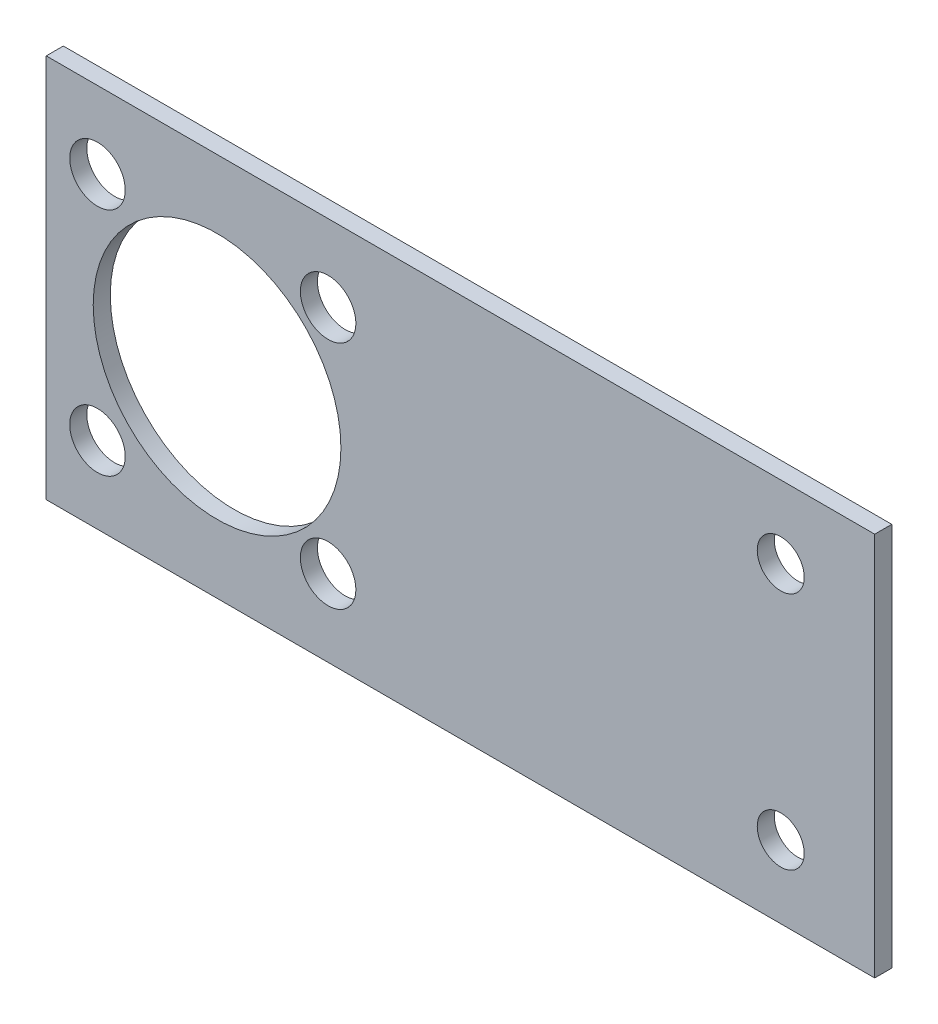
ISO-10303-21;
HEADER;
FILE_DESCRIPTION(('STEP AP214'),'2;1');
FILE_NAME('part.step','',(''),(''),'','','');
FILE_SCHEMA(('AUTOMOTIVE_DESIGN { 1 0 10303 214 1 1 1 1 }'));
ENDSEC;
DATA;
#1=APPLICATION_CONTEXT('core data for automotive mechanical design processes');
#2=APPLICATION_PROTOCOL_DEFINITION('international standard','automotive_design',2000,#1);
#3=PRODUCT_CONTEXT('',#1,'mechanical');
#4=PRODUCT('Part','Part','',(#3));
#5=PRODUCT_RELATED_PRODUCT_CATEGORY('part','',(#4));
#6=PRODUCT_DEFINITION_FORMATION('','',#4);
#7=PRODUCT_DEFINITION_CONTEXT('part definition',#1,'design');
#8=PRODUCT_DEFINITION('design','',#6,#7);
#9=PRODUCT_DEFINITION_SHAPE('','',#8);
#10=(LENGTH_UNIT() NAMED_UNIT(*) SI_UNIT(.MILLI.,.METRE.));
#11=(NAMED_UNIT(*) PLANE_ANGLE_UNIT() SI_UNIT($,.RADIAN.));
#12=(NAMED_UNIT(*) SI_UNIT($,.STERADIAN.) SOLID_ANGLE_UNIT());
#13=UNCERTAINTY_MEASURE_WITH_UNIT(LENGTH_MEASURE(1.E-05),#10,'distance_accuracy_value','');
#14=(GEOMETRIC_REPRESENTATION_CONTEXT(3) GLOBAL_UNCERTAINTY_ASSIGNED_CONTEXT((#13)) GLOBAL_UNIT_ASSIGNED_CONTEXT((#10,
#11,#12)) REPRESENTATION_CONTEXT('',''));
#15=CARTESIAN_POINT('',(0.,0.,0.));
#16=DIRECTION('',(0.,0.,1.));
#17=DIRECTION('',(1.,0.,0.));
#18=AXIS2_PLACEMENT_3D('',#15,#16,#17);
#19=CARTESIAN_POINT('',(37.991244901112,22.5,-1.99999999999999));
#20=DIRECTION('',(0.,1.,0.));
#21=DIRECTION('',(1.,0.,0.));
#22=AXIS2_PLACEMENT_3D('',#19,#20,#21);
#23=PLANE('',#22);
#24=DIRECTION('',(-1.,0.,0.));
#25=VECTOR('',#24,1.);
#26=CARTESIAN_POINT('',(37.991244901112,22.5,-1.99999999999999));
#27=LINE('',#26,#25);
#28=CARTESIAN_POINT('',(60.991244901112,22.5,-2.00000000000016));
#29=VERTEX_POINT('',#28);
#30=CARTESIAN_POINT('',(-36.,22.5,-2.));
#31=VERTEX_POINT('',#30);
#32=EDGE_CURVE('E117',#29,#31,#27,.T.);
#33=ORIENTED_EDGE('',*,*,#32,.T.);
#34=DIRECTION('',(0.,0.,1.));
#35=VECTOR('',#34,1.);
#36=CARTESIAN_POINT('',(-36.,22.5,-2.));
#37=LINE('',#36,#35);
#38=CARTESIAN_POINT('',(-36.,22.5,0.));
#39=VERTEX_POINT('',#38);
#40=EDGE_CURVE('E119',#31,#39,#37,.T.);
#41=ORIENTED_EDGE('',*,*,#40,.T.);
#42=DIRECTION('',(1.,0.,0.));
#43=VECTOR('',#42,1.);
#44=CARTESIAN_POINT('',(37.9912449011119,22.5,0.));
#45=LINE('',#44,#43);
#46=CARTESIAN_POINT('',(60.991244901112,22.5,-1.59594559789866E-13));
#47=VERTEX_POINT('',#46);
#48=EDGE_CURVE('E108',#47,#39,#45,.F.);
#49=ORIENTED_EDGE('',*,*,#48,.F.);
#50=DIRECTION('',(0.,0.,1.));
#51=VECTOR('',#50,1.);
#52=CARTESIAN_POINT('',(60.991244901112,22.5,-2.00000000000016));
#53=LINE('',#52,#51);
#54=EDGE_CURVE('E13',#29,#47,#53,.T.);
#55=ORIENTED_EDGE('',*,*,#54,.F.);
#56=EDGE_LOOP('',(#33,#41,#49,#55));
#57=FACE_BOUND('',#56,.T.);
#58=ADVANCED_FACE('F69',(#57),#23,.T.);
#59=CARTESIAN_POINT('',(60.991244901112,-22.5,-2.00000000000016));
#60=DIRECTION('',(0.,-1.,0.));
#61=DIRECTION('',(-1.,0.,0.));
#62=AXIS2_PLACEMENT_3D('',#59,#60,#61);
#63=PLANE('',#62);
#64=DIRECTION('',(-1.,0.,0.));
#65=VECTOR('',#64,1.);
#66=CARTESIAN_POINT('',(37.9912449011119,-22.5,0.));
#67=LINE('',#66,#65);
#68=CARTESIAN_POINT('',(-36.,-22.5,0.));
#69=VERTEX_POINT('',#68);
#70=CARTESIAN_POINT('',(60.991244901112,-22.5,-1.59594559789866E-13));
#71=VERTEX_POINT('',#70);
#72=EDGE_CURVE('E103',#69,#71,#67,.F.);
#73=ORIENTED_EDGE('',*,*,#72,.F.);
#74=DIRECTION('',(0.,0.,1.));
#75=VECTOR('',#74,1.);
#76=CARTESIAN_POINT('',(-36.,-22.5,-2.));
#77=LINE('',#76,#75);
#78=CARTESIAN_POINT('',(-36.,-22.5,-2.));
#79=VERTEX_POINT('',#78);
#80=EDGE_CURVE('E139',#79,#69,#77,.T.);
#81=ORIENTED_EDGE('',*,*,#80,.F.);
#82=DIRECTION('',(1.,0.,0.));
#83=VECTOR('',#82,1.);
#84=CARTESIAN_POINT('',(60.991244901112,-22.5,-2.00000000000016));
#85=LINE('',#84,#83);
#86=CARTESIAN_POINT('',(60.991244901112,-22.5,-2.00000000000016));
#87=VERTEX_POINT('',#86);
#88=EDGE_CURVE('E137',#79,#87,#85,.T.);
#89=ORIENTED_EDGE('',*,*,#88,.T.);
#90=DIRECTION('',(0.,0.,1.));
#91=VECTOR('',#90,1.);
#92=CARTESIAN_POINT('',(60.991244901112,-22.5,-2.00000000000016));
#93=LINE('',#92,#91);
#94=EDGE_CURVE('E80',#87,#71,#93,.T.);
#95=ORIENTED_EDGE('',*,*,#94,.T.);
#96=EDGE_LOOP('',(#73,#81,#89,#95));
#97=FACE_BOUND('',#96,.T.);
#98=ADVANCED_FACE('F191',(#97),#63,.T.);
#99=CARTESIAN_POINT('',(37.9912449011119,0.,-1.99999999999999));
#100=DIRECTION('',(0.,0.,-1.));
#101=DIRECTION('',(-1.,0.,0.));
#102=AXIS2_PLACEMENT_3D('',#99,#100,#101);
#103=PLANE('',#102);
#104=CARTESIAN_POINT('',(49.991244901112,14.,-2.00000000000008));
#105=DIRECTION('',(0.,0.,-1.));
#106=DIRECTION('',(-1.,0.,0.));
#107=AXIS2_PLACEMENT_3D('',#104,#105,#106);
#108=CIRCLE('',#107,2.75);
#109=CARTESIAN_POINT('',(47.241244901112,14.,-2.00000000000006));
#110=VERTEX_POINT('',#109);
#111=EDGE_CURVE('E146',#110,#110,#108,.T.);
#112=ORIENTED_EDGE('',*,*,#111,.F.);
#113=EDGE_LOOP('',(#112));
#114=FACE_BOUND('',#113,.T.);
#115=CARTESIAN_POINT('',(49.991244901112,-14.,-2.00000000000008));
#116=DIRECTION('',(0.,0.,-1.));
#117=DIRECTION('',(-1.,0.,0.));
#118=AXIS2_PLACEMENT_3D('',#115,#116,#117);
#119=CIRCLE('',#118,2.75);
#120=CARTESIAN_POINT('',(47.241244901112,-14.,-2.00000000000006));
#121=VERTEX_POINT('',#120);
#122=EDGE_CURVE('E133',#121,#121,#119,.T.);
#123=ORIENTED_EDGE('',*,*,#122,.F.);
#124=EDGE_LOOP('',(#123));
#125=FACE_BOUND('',#124,.T.);
#126=ORIENTED_EDGE('',*,*,#88,.F.);
#127=DIRECTION('',(0.,-1.,0.));
#128=VECTOR('',#127,1.);
#129=CARTESIAN_POINT('',(-36.,22.5,-2.));
#130=LINE('',#129,#128);
#131=EDGE_CURVE('E130',#31,#79,#130,.T.);
#132=ORIENTED_EDGE('',*,*,#131,.F.);
#133=ORIENTED_EDGE('',*,*,#32,.F.);
#134=DIRECTION('',(0.,1.,0.));
#135=VECTOR('',#134,1.);
#136=CARTESIAN_POINT('',(60.991244901112,22.5,-2.00000000000016));
#137=LINE('',#136,#135);
#138=EDGE_CURVE('E125',#87,#29,#137,.T.);
#139=ORIENTED_EDGE('',*,*,#138,.F.);
#140=EDGE_LOOP('',(#126,#132,#133,#139));
#141=FACE_BOUND('',#140,.T.);
#142=CARTESIAN_POINT('',(-3.,13.5,-2.));
#143=DIRECTION('',(0.,0.,1.));
#144=DIRECTION('',(1.,0.,0.));
#145=AXIS2_PLACEMENT_3D('',#142,#143,#144);
#146=CIRCLE('',#145,3.25);
#147=CARTESIAN_POINT('',(0.250000000000002,13.5,-2.));
#148=VERTEX_POINT('',#147);
#149=EDGE_CURVE('E233',#148,#148,#146,.T.);
#150=ORIENTED_EDGE('',*,*,#149,.T.);
#151=EDGE_LOOP('',(#150));
#152=FACE_BOUND('',#151,.T.);
#153=CARTESIAN_POINT('',(-30.,-13.5,-2.));
#154=DIRECTION('',(0.,0.,1.));
#155=DIRECTION('',(1.,0.,0.));
#156=AXIS2_PLACEMENT_3D('',#153,#154,#155);
#157=CIRCLE('',#156,3.25);
#158=CARTESIAN_POINT('',(-26.75,-13.5,-2.));
#159=VERTEX_POINT('',#158);
#160=EDGE_CURVE('E237',#159,#159,#157,.T.);
#161=ORIENTED_EDGE('',*,*,#160,.T.);
#162=EDGE_LOOP('',(#161));
#163=FACE_BOUND('',#162,.T.);
#164=CARTESIAN_POINT('',(-3.,-13.5,-2.));
#165=DIRECTION('',(0.,0.,1.));
#166=DIRECTION('',(1.,0.,0.));
#167=AXIS2_PLACEMENT_3D('',#164,#165,#166);
#168=CIRCLE('',#167,3.25);
#169=CARTESIAN_POINT('',(0.250000000000002,-13.5,-2.));
#170=VERTEX_POINT('',#169);
#171=EDGE_CURVE('E241',#170,#170,#168,.T.);
#172=ORIENTED_EDGE('',*,*,#171,.T.);
#173=EDGE_LOOP('',(#172));
#174=FACE_BOUND('',#173,.T.);
#175=CARTESIAN_POINT('',(-30.,13.5,-2.));
#176=DIRECTION('',(0.,0.,1.));
#177=DIRECTION('',(1.,0.,0.));
#178=AXIS2_PLACEMENT_3D('',#175,#176,#177);
#179=CIRCLE('',#178,3.25);
#180=CARTESIAN_POINT('',(-26.75,13.5,-2.));
#181=VERTEX_POINT('',#180);
#182=EDGE_CURVE('E245',#181,#181,#179,.T.);
#183=ORIENTED_EDGE('',*,*,#182,.T.);
#184=EDGE_LOOP('',(#183));
#185=FACE_BOUND('',#184,.T.);
#186=CARTESIAN_POINT('',(-16.,0.,-2.));
#187=DIRECTION('',(0.,0.,1.));
#188=DIRECTION('',(1.,0.,0.));
#189=AXIS2_PLACEMENT_3D('',#186,#187,#188);
#190=CIRCLE('',#189,14.5);
#191=CARTESIAN_POINT('',(-1.5,0.,-2.));
#192=VERTEX_POINT('',#191);
#193=EDGE_CURVE('E249',#192,#192,#190,.T.);
#194=ORIENTED_EDGE('',*,*,#193,.T.);
#195=EDGE_LOOP('',(#194));
#196=FACE_BOUND('',#195,.T.);
#197=ADVANCED_FACE('F135',(#114,#125,#141,#152,#163,#174,#185,#196),#103,.T.);
#198=CARTESIAN_POINT('',(0.,0.,0.));
#199=DIRECTION('',(0.,0.,1.));
#200=DIRECTION('',(1.,0.,0.));
#201=AXIS2_PLACEMENT_3D('',#198,#199,#200);
#202=PLANE('',#201);
#203=CARTESIAN_POINT('',(49.991244901112,14.,0.));
#204=DIRECTION('',(0.,0.,-1.));
#205=DIRECTION('',(-1.,0.,0.));
#206=AXIS2_PLACEMENT_3D('',#203,#204,#205);
#207=CIRCLE('',#206,2.75);
#208=CARTESIAN_POINT('',(47.2412449011121,14.,0.));
#209=VERTEX_POINT('',#208);
#210=EDGE_CURVE('E73',#209,#209,#207,.T.);
#211=ORIENTED_EDGE('',*,*,#210,.T.);
#212=EDGE_LOOP('',(#211));
#213=FACE_BOUND('',#212,.T.);
#214=CARTESIAN_POINT('',(49.991244901112,-14.,0.));
#215=DIRECTION('',(0.,0.,-1.));
#216=DIRECTION('',(-1.,0.,0.));
#217=AXIS2_PLACEMENT_3D('',#214,#215,#216);
#218=CIRCLE('',#217,2.75);
#219=CARTESIAN_POINT('',(47.2412449011121,-14.,0.));
#220=VERTEX_POINT('',#219);
#221=EDGE_CURVE('E150',#220,#220,#218,.T.);
#222=ORIENTED_EDGE('',*,*,#221,.T.);
#223=EDGE_LOOP('',(#222));
#224=FACE_BOUND('',#223,.T.);
#225=ORIENTED_EDGE('',*,*,#48,.T.);
#226=DIRECTION('',(0.,-1.,0.));
#227=VECTOR('',#226,1.);
#228=CARTESIAN_POINT('',(-36.,22.5,0.));
#229=LINE('',#228,#227);
#230=EDGE_CURVE('E131',#39,#69,#229,.T.);
#231=ORIENTED_EDGE('',*,*,#230,.T.);
#232=ORIENTED_EDGE('',*,*,#72,.T.);
#233=DIRECTION('',(0.,-1.,0.));
#234=VECTOR('',#233,1.);
#235=CARTESIAN_POINT('',(60.991244901112,0.,-1.59594559789866E-13));
#236=LINE('',#235,#234);
#237=EDGE_CURVE('E162',#71,#47,#236,.F.);
#238=ORIENTED_EDGE('',*,*,#237,.T.);
#239=EDGE_LOOP('',(#225,#231,#232,#238));
#240=FACE_BOUND('',#239,.T.);
#241=CARTESIAN_POINT('',(-3.,13.5,0.));
#242=DIRECTION('',(0.,0.,1.));
#243=DIRECTION('',(1.,0.,0.));
#244=AXIS2_PLACEMENT_3D('',#241,#242,#243);
#245=CIRCLE('',#244,3.25);
#246=CARTESIAN_POINT('',(0.250000000000002,13.5,0.));
#247=VERTEX_POINT('',#246);
#248=EDGE_CURVE('E207',#247,#247,#245,.T.);
#249=ORIENTED_EDGE('',*,*,#248,.F.);
#250=EDGE_LOOP('',(#249));
#251=FACE_BOUND('',#250,.T.);
#252=CARTESIAN_POINT('',(-30.,-13.5,0.));
#253=DIRECTION('',(0.,0.,1.));
#254=DIRECTION('',(1.,0.,0.));
#255=AXIS2_PLACEMENT_3D('',#252,#253,#254);
#256=CIRCLE('',#255,3.25);
#257=CARTESIAN_POINT('',(-26.75,-13.5,0.));
#258=VERTEX_POINT('',#257);
#259=EDGE_CURVE('E211',#258,#258,#256,.T.);
#260=ORIENTED_EDGE('',*,*,#259,.F.);
#261=EDGE_LOOP('',(#260));
#262=FACE_BOUND('',#261,.T.);
#263=CARTESIAN_POINT('',(-3.,-13.5,0.));
#264=DIRECTION('',(0.,0.,1.));
#265=DIRECTION('',(1.,0.,0.));
#266=AXIS2_PLACEMENT_3D('',#263,#264,#265);
#267=CIRCLE('',#266,3.25);
#268=CARTESIAN_POINT('',(0.250000000000002,-13.5,0.));
#269=VERTEX_POINT('',#268);
#270=EDGE_CURVE('E215',#269,#269,#267,.T.);
#271=ORIENTED_EDGE('',*,*,#270,.F.);
#272=EDGE_LOOP('',(#271));
#273=FACE_BOUND('',#272,.T.);
#274=CARTESIAN_POINT('',(-30.,13.5,0.));
#275=DIRECTION('',(0.,0.,1.));
#276=DIRECTION('',(1.,0.,0.));
#277=AXIS2_PLACEMENT_3D('',#274,#275,#276);
#278=CIRCLE('',#277,3.25);
#279=CARTESIAN_POINT('',(-26.75,13.5,0.));
#280=VERTEX_POINT('',#279);
#281=EDGE_CURVE('E219',#280,#280,#278,.T.);
#282=ORIENTED_EDGE('',*,*,#281,.F.);
#283=EDGE_LOOP('',(#282));
#284=FACE_BOUND('',#283,.T.);
#285=CARTESIAN_POINT('',(-16.,0.,0.));
#286=DIRECTION('',(0.,0.,1.));
#287=DIRECTION('',(1.,0.,0.));
#288=AXIS2_PLACEMENT_3D('',#285,#286,#287);
#289=CIRCLE('',#288,14.5);
#290=CARTESIAN_POINT('',(-1.5,0.,0.));
#291=VERTEX_POINT('',#290);
#292=EDGE_CURVE('E142',#291,#291,#289,.T.);
#293=ORIENTED_EDGE('',*,*,#292,.F.);
#294=EDGE_LOOP('',(#293));
#295=FACE_BOUND('',#294,.T.);
#296=ADVANCED_FACE('F71',(#213,#224,#240,#251,#262,#273,#284,#295),#202,.T.);
#297=CARTESIAN_POINT('',(60.991244901112,22.5,-2.00000000000016));
#298=DIRECTION('',(1.,0.,0.));
#299=DIRECTION('',(0.,0.,-1.));
#300=AXIS2_PLACEMENT_3D('',#297,#298,#299);
#301=PLANE('',#300);
#302=ORIENTED_EDGE('',*,*,#237,.F.);
#303=ORIENTED_EDGE('',*,*,#94,.F.);
#304=ORIENTED_EDGE('',*,*,#138,.T.);
#305=ORIENTED_EDGE('',*,*,#54,.T.);
#306=EDGE_LOOP('',(#302,#303,#304,#305));
#307=FACE_BOUND('',#306,.T.);
#308=ADVANCED_FACE('F186',(#307),#301,.T.);
#309=CARTESIAN_POINT('',(49.9912449011126,-14.,72.7366));
#310=DIRECTION('',(0.,0.,-1.));
#311=DIRECTION('',(-1.,0.,0.));
#312=AXIS2_PLACEMENT_3D('',#309,#310,#311);
#313=CYLINDRICAL_SURFACE('',#312,2.75);
#314=ORIENTED_EDGE('',*,*,#122,.T.);
#315=EDGE_LOOP('',(#314));
#316=FACE_BOUND('',#315,.T.);
#317=ORIENTED_EDGE('',*,*,#221,.F.);
#318=EDGE_LOOP('',(#317));
#319=FACE_BOUND('',#318,.T.);
#320=ADVANCED_FACE('F177',(#316,#319),#313,.F.);
#321=CARTESIAN_POINT('',(49.9912449011126,14.,72.7366));
#322=DIRECTION('',(0.,0.,-1.));
#323=DIRECTION('',(-1.,0.,0.));
#324=AXIS2_PLACEMENT_3D('',#321,#322,#323);
#325=CYLINDRICAL_SURFACE('',#324,2.75);
#326=ORIENTED_EDGE('',*,*,#111,.T.);
#327=EDGE_LOOP('',(#326));
#328=FACE_BOUND('',#327,.T.);
#329=ORIENTED_EDGE('',*,*,#210,.F.);
#330=EDGE_LOOP('',(#329));
#331=FACE_BOUND('',#330,.T.);
#332=ADVANCED_FACE('F175',(#328,#331),#325,.F.);
#333=CARTESIAN_POINT('',(-36.,22.5,-2.));
#334=DIRECTION('',(-1.,0.,0.));
#335=DIRECTION('',(0.,-1.,0.));
#336=AXIS2_PLACEMENT_3D('',#333,#334,#335);
#337=PLANE('',#336);
#338=ORIENTED_EDGE('',*,*,#230,.F.);
#339=ORIENTED_EDGE('',*,*,#40,.F.);
#340=ORIENTED_EDGE('',*,*,#131,.T.);
#341=ORIENTED_EDGE('',*,*,#80,.T.);
#342=EDGE_LOOP('',(#338,#339,#340,#341));
#343=FACE_BOUND('',#342,.T.);
#344=ADVANCED_FACE('F129',(#343),#337,.T.);
#345=CARTESIAN_POINT('',(-16.,0.,-2.));
#346=DIRECTION('',(0.,0.,1.));
#347=DIRECTION('',(1.,0.,0.));
#348=AXIS2_PLACEMENT_3D('',#345,#346,#347);
#349=CYLINDRICAL_SURFACE('',#348,14.5);
#350=ORIENTED_EDGE('',*,*,#193,.F.);
#351=EDGE_LOOP('',(#350));
#352=FACE_BOUND('',#351,.T.);
#353=ORIENTED_EDGE('',*,*,#292,.T.);
#354=EDGE_LOOP('',(#353));
#355=FACE_BOUND('',#354,.T.);
#356=ADVANCED_FACE('F184',(#352,#355),#349,.F.);
#357=CARTESIAN_POINT('',(-30.,13.5,-2.));
#358=DIRECTION('',(0.,0.,1.));
#359=DIRECTION('',(1.,0.,0.));
#360=AXIS2_PLACEMENT_3D('',#357,#358,#359);
#361=CYLINDRICAL_SURFACE('',#360,3.25);
#362=ORIENTED_EDGE('',*,*,#182,.F.);
#363=EDGE_LOOP('',(#362));
#364=FACE_BOUND('',#363,.T.);
#365=ORIENTED_EDGE('',*,*,#281,.T.);
#366=EDGE_LOOP('',(#365));
#367=FACE_BOUND('',#366,.T.);
#368=ADVANCED_FACE('F258',(#364,#367),#361,.F.);
#369=CARTESIAN_POINT('',(-3.,-13.5,-2.));
#370=DIRECTION('',(0.,0.,1.));
#371=DIRECTION('',(1.,0.,0.));
#372=AXIS2_PLACEMENT_3D('',#369,#370,#371);
#373=CYLINDRICAL_SURFACE('',#372,3.25);
#374=ORIENTED_EDGE('',*,*,#171,.F.);
#375=EDGE_LOOP('',(#374));
#376=FACE_BOUND('',#375,.T.);
#377=ORIENTED_EDGE('',*,*,#270,.T.);
#378=EDGE_LOOP('',(#377));
#379=FACE_BOUND('',#378,.T.);
#380=ADVANCED_FACE('F263',(#376,#379),#373,.F.);
#381=CARTESIAN_POINT('',(-30.,-13.5,-2.));
#382=DIRECTION('',(0.,0.,1.));
#383=DIRECTION('',(1.,0.,0.));
#384=AXIS2_PLACEMENT_3D('',#381,#382,#383);
#385=CYLINDRICAL_SURFACE('',#384,3.25);
#386=ORIENTED_EDGE('',*,*,#160,.F.);
#387=EDGE_LOOP('',(#386));
#388=FACE_BOUND('',#387,.T.);
#389=ORIENTED_EDGE('',*,*,#259,.T.);
#390=EDGE_LOOP('',(#389));
#391=FACE_BOUND('',#390,.T.);
#392=ADVANCED_FACE('F269',(#388,#391),#385,.F.);
#393=CARTESIAN_POINT('',(-3.,13.5,-2.));
#394=DIRECTION('',(0.,0.,1.));
#395=DIRECTION('',(1.,0.,0.));
#396=AXIS2_PLACEMENT_3D('',#393,#394,#395);
#397=CYLINDRICAL_SURFACE('',#396,3.25);
#398=ORIENTED_EDGE('',*,*,#149,.F.);
#399=EDGE_LOOP('',(#398));
#400=FACE_BOUND('',#399,.T.);
#401=ORIENTED_EDGE('',*,*,#248,.T.);
#402=EDGE_LOOP('',(#401));
#403=FACE_BOUND('',#402,.T.);
#404=ADVANCED_FACE('F272',(#400,#403),#397,.F.);
#405=CLOSED_SHELL('',(#58,#98,#197,#296,#308,#320,#332,#344,#356,#368,#380,#392,#404));
#406=MANIFOLD_SOLID_BREP('B2',#405);
#407=ADVANCED_BREP_SHAPE_REPRESENTATION('',(#18,#406),#14);
#408=SHAPE_DEFINITION_REPRESENTATION(#9,#407);
ENDSEC;
END-ISO-10303-21;
